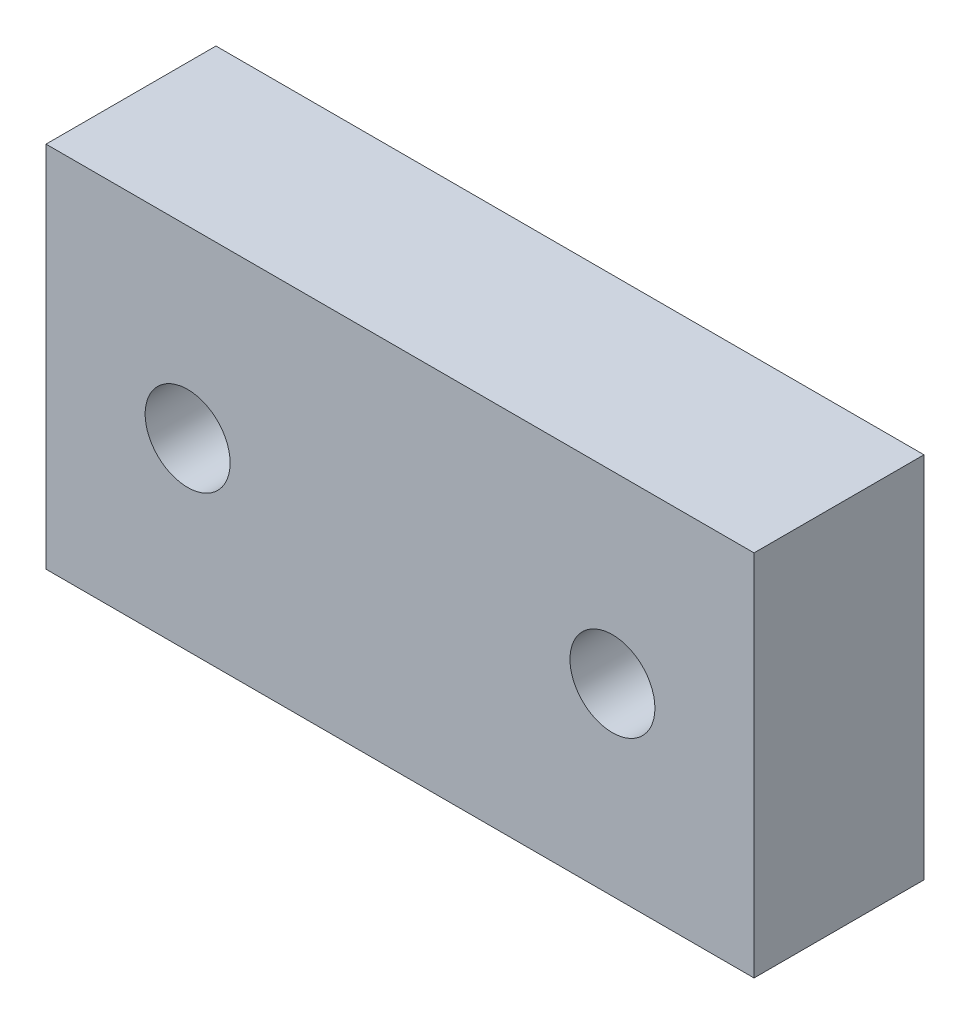
ISO-10303-21;
HEADER;
FILE_DESCRIPTION(('STEP AP214'),'2;1');
FILE_NAME('part.step','',(''),(''),'','','');
FILE_SCHEMA(('AUTOMOTIVE_DESIGN { 1 0 10303 214 1 1 1 1 }'));
ENDSEC;
DATA;
#1=APPLICATION_CONTEXT('core data for automotive mechanical design processes');
#2=APPLICATION_PROTOCOL_DEFINITION('international standard','automotive_design',2000,#1);
#3=PRODUCT_CONTEXT('',#1,'mechanical');
#4=PRODUCT('Part','Part','',(#3));
#5=PRODUCT_RELATED_PRODUCT_CATEGORY('part','',(#4));
#6=PRODUCT_DEFINITION_FORMATION('','',#4);
#7=PRODUCT_DEFINITION_CONTEXT('part definition',#1,'design');
#8=PRODUCT_DEFINITION('design','',#6,#7);
#9=PRODUCT_DEFINITION_SHAPE('','',#8);
#10=(LENGTH_UNIT() NAMED_UNIT(*) SI_UNIT(.MILLI.,.METRE.));
#11=(NAMED_UNIT(*) PLANE_ANGLE_UNIT() SI_UNIT($,.RADIAN.));
#12=(NAMED_UNIT(*) SI_UNIT($,.STERADIAN.) SOLID_ANGLE_UNIT());
#13=UNCERTAINTY_MEASURE_WITH_UNIT(LENGTH_MEASURE(1.E-05),#10,'distance_accuracy_value','');
#14=(GEOMETRIC_REPRESENTATION_CONTEXT(3) GLOBAL_UNCERTAINTY_ASSIGNED_CONTEXT((#13)) GLOBAL_UNIT_ASSIGNED_CONTEXT((#10,
#11,#12)) REPRESENTATION_CONTEXT('',''));
#15=CARTESIAN_POINT('',(0.,0.,0.));
#16=DIRECTION('',(0.,0.,1.));
#17=DIRECTION('',(1.,0.,0.));
#18=AXIS2_PLACEMENT_3D('',#15,#16,#17);
#19=CARTESIAN_POINT('',(0.,13.,6.));
#20=DIRECTION('',(0.,1.,0.));
#21=DIRECTION('',(0.,0.,1.));
#22=AXIS2_PLACEMENT_3D('',#19,#20,#21);
#23=PLANE('',#22);
#24=DIRECTION('',(1.,0.,0.));
#25=VECTOR('',#24,1.);
#26=CARTESIAN_POINT('',(0.,13.,0.));
#27=LINE('',#26,#25);
#28=CARTESIAN_POINT('',(0.,13.,0.));
#29=VERTEX_POINT('',#28);
#30=CARTESIAN_POINT('',(25.,13.,0.));
#31=VERTEX_POINT('',#30);
#32=EDGE_CURVE('E110',#29,#31,#27,.T.);
#33=ORIENTED_EDGE('',*,*,#32,.F.);
#34=DIRECTION('',(0.,0.,-1.));
#35=VECTOR('',#34,1.);
#36=CARTESIAN_POINT('',(0.,13.,6.));
#37=LINE('',#36,#35);
#38=CARTESIAN_POINT('',(0.,13.,6.));
#39=VERTEX_POINT('',#38);
#40=EDGE_CURVE('E11',#39,#29,#37,.T.);
#41=ORIENTED_EDGE('',*,*,#40,.F.);
#42=DIRECTION('',(1.,0.,0.));
#43=VECTOR('',#42,1.);
#44=CARTESIAN_POINT('',(0.,13.,6.));
#45=LINE('',#44,#43);
#46=CARTESIAN_POINT('',(25.,13.,6.));
#47=VERTEX_POINT('',#46);
#48=EDGE_CURVE('E97',#39,#47,#45,.T.);
#49=ORIENTED_EDGE('',*,*,#48,.T.);
#50=DIRECTION('',(0.,0.,-1.));
#51=VECTOR('',#50,1.);
#52=CARTESIAN_POINT('',(25.,13.,6.));
#53=LINE('',#52,#51);
#54=EDGE_CURVE('E76',#47,#31,#53,.T.);
#55=ORIENTED_EDGE('',*,*,#54,.T.);
#56=EDGE_LOOP('',(#33,#41,#49,#55));
#57=FACE_BOUND('',#56,.T.);
#58=ADVANCED_FACE('F36',(#57),#23,.T.);
#59=CARTESIAN_POINT('',(0.,0.,6.));
#60=DIRECTION('',(-1.,0.,0.));
#61=DIRECTION('',(0.,0.,1.));
#62=AXIS2_PLACEMENT_3D('',#59,#60,#61);
#63=PLANE('',#62);
#64=DIRECTION('',(0.,1.,0.));
#65=VECTOR('',#64,1.);
#66=CARTESIAN_POINT('',(0.,0.,0.));
#67=LINE('',#66,#65);
#68=CARTESIAN_POINT('',(0.,0.,0.));
#69=VERTEX_POINT('',#68);
#70=EDGE_CURVE('E88',#69,#29,#67,.T.);
#71=ORIENTED_EDGE('',*,*,#70,.F.);
#72=DIRECTION('',(0.,0.,-1.));
#73=VECTOR('',#72,1.);
#74=CARTESIAN_POINT('',(0.,0.,6.));
#75=LINE('',#74,#73);
#76=CARTESIAN_POINT('',(0.,0.,6.));
#77=VERTEX_POINT('',#76);
#78=EDGE_CURVE('E45',#77,#69,#75,.T.);
#79=ORIENTED_EDGE('',*,*,#78,.F.);
#80=DIRECTION('',(0.,1.,0.));
#81=VECTOR('',#80,1.);
#82=CARTESIAN_POINT('',(0.,0.,6.));
#83=LINE('',#82,#81);
#84=EDGE_CURVE('E86',#77,#39,#83,.T.);
#85=ORIENTED_EDGE('',*,*,#84,.T.);
#86=ORIENTED_EDGE('',*,*,#40,.T.);
#87=EDGE_LOOP('',(#71,#79,#85,#86));
#88=FACE_BOUND('',#87,.T.);
#89=ADVANCED_FACE('F84',(#88),#63,.T.);
#90=CARTESIAN_POINT('',(0.,0.,6.));
#91=DIRECTION('',(0.,1.,0.));
#92=DIRECTION('',(0.,0.,1.));
#93=AXIS2_PLACEMENT_3D('',#90,#91,#92);
#94=PLANE('',#93);
#95=DIRECTION('',(1.,0.,0.));
#96=VECTOR('',#95,1.);
#97=CARTESIAN_POINT('',(0.,0.,0.));
#98=LINE('',#97,#96);
#99=CARTESIAN_POINT('',(25.,0.,0.));
#100=VERTEX_POINT('',#99);
#101=EDGE_CURVE('E113',#69,#100,#98,.T.);
#102=ORIENTED_EDGE('',*,*,#101,.T.);
#103=DIRECTION('',(0.,0.,-1.));
#104=VECTOR('',#103,1.);
#105=CARTESIAN_POINT('',(25.,0.,6.));
#106=LINE('',#105,#104);
#107=CARTESIAN_POINT('',(25.,0.,6.));
#108=VERTEX_POINT('',#107);
#109=EDGE_CURVE('E91',#108,#100,#106,.T.);
#110=ORIENTED_EDGE('',*,*,#109,.F.);
#111=DIRECTION('',(1.,0.,0.));
#112=VECTOR('',#111,1.);
#113=CARTESIAN_POINT('',(0.,0.,6.));
#114=LINE('',#113,#112);
#115=EDGE_CURVE('E93',#77,#108,#114,.T.);
#116=ORIENTED_EDGE('',*,*,#115,.F.);
#117=ORIENTED_EDGE('',*,*,#78,.T.);
#118=EDGE_LOOP('',(#102,#110,#116,#117));
#119=FACE_BOUND('',#118,.T.);
#120=ADVANCED_FACE('F94',(#119),#94,.F.);
#121=CARTESIAN_POINT('',(5.,6.5,6.));
#122=DIRECTION('',(0.,0.,-1.));
#123=DIRECTION('',(-1.,0.,0.));
#124=AXIS2_PLACEMENT_3D('',#121,#122,#123);
#125=CYLINDRICAL_SURFACE('',#124,1.5);
#126=CARTESIAN_POINT('',(5.,6.5,6.));
#127=DIRECTION('',(0.,0.,1.));
#128=DIRECTION('',(1.,0.,0.));
#129=AXIS2_PLACEMENT_3D('',#126,#127,#128);
#130=CIRCLE('',#129,1.5);
#131=CARTESIAN_POINT('',(6.5,6.5,6.));
#132=VERTEX_POINT('',#131);
#133=EDGE_CURVE('E99',#132,#132,#130,.T.);
#134=ORIENTED_EDGE('',*,*,#133,.T.);
#135=EDGE_LOOP('',(#134));
#136=FACE_BOUND('',#135,.T.);
#137=CARTESIAN_POINT('',(5.,6.5,0.));
#138=DIRECTION('',(0.,0.,1.));
#139=DIRECTION('',(1.,0.,0.));
#140=AXIS2_PLACEMENT_3D('',#137,#138,#139);
#141=CIRCLE('',#140,1.5);
#142=CARTESIAN_POINT('',(6.5,6.5,0.));
#143=VERTEX_POINT('',#142);
#144=EDGE_CURVE('E107',#143,#143,#141,.T.);
#145=ORIENTED_EDGE('',*,*,#144,.F.);
#146=EDGE_LOOP('',(#145));
#147=FACE_BOUND('',#146,.T.);
#148=ADVANCED_FACE('F128',(#136,#147),#125,.F.);
#149=CARTESIAN_POINT('',(20.,6.5,6.));
#150=DIRECTION('',(0.,0.,-1.));
#151=DIRECTION('',(-1.,0.,0.));
#152=AXIS2_PLACEMENT_3D('',#149,#150,#151);
#153=CYLINDRICAL_SURFACE('',#152,1.5);
#154=CARTESIAN_POINT('',(20.,6.5,6.));
#155=DIRECTION('',(0.,0.,1.));
#156=DIRECTION('',(1.,0.,0.));
#157=AXIS2_PLACEMENT_3D('',#154,#155,#156);
#158=CIRCLE('',#157,1.5);
#159=CARTESIAN_POINT('',(21.5,6.5,6.));
#160=VERTEX_POINT('',#159);
#161=EDGE_CURVE('E116',#160,#160,#158,.T.);
#162=ORIENTED_EDGE('',*,*,#161,.T.);
#163=EDGE_LOOP('',(#162));
#164=FACE_BOUND('',#163,.T.);
#165=CARTESIAN_POINT('',(20.,6.5,0.));
#166=DIRECTION('',(0.,0.,1.));
#167=DIRECTION('',(1.,0.,0.));
#168=AXIS2_PLACEMENT_3D('',#165,#166,#167);
#169=CIRCLE('',#168,1.5);
#170=CARTESIAN_POINT('',(21.5,6.5,0.));
#171=VERTEX_POINT('',#170);
#172=EDGE_CURVE('E104',#171,#171,#169,.T.);
#173=ORIENTED_EDGE('',*,*,#172,.F.);
#174=EDGE_LOOP('',(#173));
#175=FACE_BOUND('',#174,.T.);
#176=ADVANCED_FACE('F38',(#164,#175),#153,.F.);
#177=CARTESIAN_POINT('',(25.,0.,6.));
#178=DIRECTION('',(-1.,0.,0.));
#179=DIRECTION('',(0.,0.,1.));
#180=AXIS2_PLACEMENT_3D('',#177,#178,#179);
#181=PLANE('',#180);
#182=DIRECTION('',(0.,1.,0.));
#183=VECTOR('',#182,1.);
#184=CARTESIAN_POINT('',(25.,0.,0.));
#185=LINE('',#184,#183);
#186=EDGE_CURVE('E69',#100,#31,#185,.T.);
#187=ORIENTED_EDGE('',*,*,#186,.T.);
#188=ORIENTED_EDGE('',*,*,#54,.F.);
#189=DIRECTION('',(0.,1.,0.));
#190=VECTOR('',#189,1.);
#191=CARTESIAN_POINT('',(25.,0.,6.));
#192=LINE('',#191,#190);
#193=EDGE_CURVE('E53',#108,#47,#192,.T.);
#194=ORIENTED_EDGE('',*,*,#193,.F.);
#195=ORIENTED_EDGE('',*,*,#109,.T.);
#196=EDGE_LOOP('',(#187,#188,#194,#195));
#197=FACE_BOUND('',#196,.T.);
#198=ADVANCED_FACE('F119',(#197),#181,.F.);
#199=CARTESIAN_POINT('',(0.,0.,6.));
#200=DIRECTION('',(0.,0.,1.));
#201=DIRECTION('',(1.,0.,0.));
#202=AXIS2_PLACEMENT_3D('',#199,#200,#201);
#203=PLANE('',#202);
#204=ORIENTED_EDGE('',*,*,#161,.F.);
#205=EDGE_LOOP('',(#204));
#206=FACE_BOUND('',#205,.T.);
#207=ORIENTED_EDGE('',*,*,#133,.F.);
#208=EDGE_LOOP('',(#207));
#209=FACE_BOUND('',#208,.T.);
#210=ORIENTED_EDGE('',*,*,#48,.F.);
#211=ORIENTED_EDGE('',*,*,#84,.F.);
#212=ORIENTED_EDGE('',*,*,#115,.T.);
#213=ORIENTED_EDGE('',*,*,#193,.T.);
#214=EDGE_LOOP('',(#210,#211,#212,#213));
#215=FACE_BOUND('',#214,.T.);
#216=ADVANCED_FACE('F96',(#206,#209,#215),#203,.T.);
#217=CARTESIAN_POINT('',(0.,0.,0.));
#218=DIRECTION('',(0.,0.,1.));
#219=DIRECTION('',(1.,0.,0.));
#220=AXIS2_PLACEMENT_3D('',#217,#218,#219);
#221=PLANE('',#220);
#222=ORIENTED_EDGE('',*,*,#172,.T.);
#223=EDGE_LOOP('',(#222));
#224=FACE_BOUND('',#223,.T.);
#225=ORIENTED_EDGE('',*,*,#144,.T.);
#226=EDGE_LOOP('',(#225));
#227=FACE_BOUND('',#226,.T.);
#228=ORIENTED_EDGE('',*,*,#32,.T.);
#229=ORIENTED_EDGE('',*,*,#186,.F.);
#230=ORIENTED_EDGE('',*,*,#101,.F.);
#231=ORIENTED_EDGE('',*,*,#70,.T.);
#232=EDGE_LOOP('',(#228,#229,#230,#231));
#233=FACE_BOUND('',#232,.T.);
#234=ADVANCED_FACE('F120',(#224,#227,#233),#221,.F.);
#235=CLOSED_SHELL('',(#58,#89,#120,#148,#176,#198,#216,#234));
#236=MANIFOLD_SOLID_BREP('B2',#235);
#237=ADVANCED_BREP_SHAPE_REPRESENTATION('',(#18,#236),#14);
#238=SHAPE_DEFINITION_REPRESENTATION(#9,#237);
ENDSEC;
END-ISO-10303-21;
